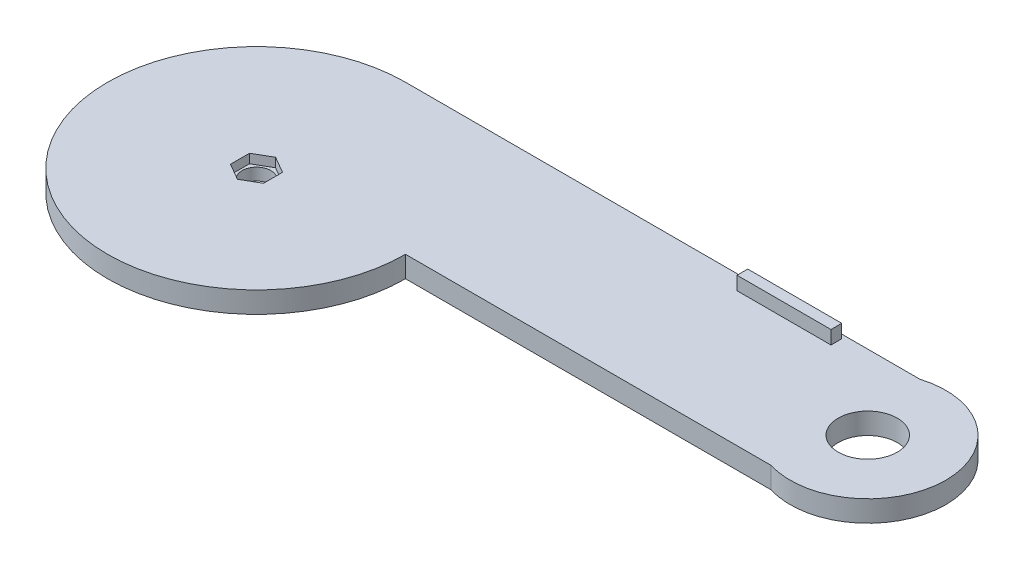
ISO-10303-21;
HEADER;
FILE_DESCRIPTION(('STEP AP214'),'2;1');
FILE_NAME('part.step','',(''),(''),'','','');
FILE_SCHEMA(('AUTOMOTIVE_DESIGN { 1 0 10303 214 1 1 1 1 }'));
ENDSEC;
DATA;
#1=APPLICATION_CONTEXT('core data for automotive mechanical design processes');
#2=APPLICATION_PROTOCOL_DEFINITION('international standard','automotive_design',2000,#1);
#3=PRODUCT_CONTEXT('',#1,'mechanical');
#4=PRODUCT('Part','Part','',(#3));
#5=PRODUCT_RELATED_PRODUCT_CATEGORY('part','',(#4));
#6=PRODUCT_DEFINITION_FORMATION('','',#4);
#7=PRODUCT_DEFINITION_CONTEXT('part definition',#1,'design');
#8=PRODUCT_DEFINITION('design','',#6,#7);
#9=PRODUCT_DEFINITION_SHAPE('','',#8);
#10=(LENGTH_UNIT() NAMED_UNIT(*) SI_UNIT(.MILLI.,.METRE.));
#11=(NAMED_UNIT(*) PLANE_ANGLE_UNIT() SI_UNIT($,.RADIAN.));
#12=(NAMED_UNIT(*) SI_UNIT($,.STERADIAN.) SOLID_ANGLE_UNIT());
#13=UNCERTAINTY_MEASURE_WITH_UNIT(LENGTH_MEASURE(1.E-05),#10,'distance_accuracy_value','');
#14=(GEOMETRIC_REPRESENTATION_CONTEXT(3) GLOBAL_UNCERTAINTY_ASSIGNED_CONTEXT((#13)) GLOBAL_UNIT_ASSIGNED_CONTEXT((#10,
#11,#12)) REPRESENTATION_CONTEXT('',''));
#15=CARTESIAN_POINT('',(0.,0.,0.));
#16=DIRECTION('',(0.,0.,1.));
#17=DIRECTION('',(1.,0.,0.));
#18=AXIS2_PLACEMENT_3D('',#15,#16,#17);
#19=CARTESIAN_POINT('',(0.,-2.1,0.));
#20=DIRECTION('',(0.,1.,0.));
#21=DIRECTION('',(0.,0.,1.));
#22=AXIS2_PLACEMENT_3D('',#19,#20,#21);
#23=CYLINDRICAL_SURFACE('',#22,5.34101538895491);
#24=CARTESIAN_POINT('',(0.,0.,0.));
#25=DIRECTION('',(0.,1.,0.));
#26=DIRECTION('',(0.,0.,1.));
#27=AXIS2_PLACEMENT_3D('',#24,#25,#26);
#28=CIRCLE('',#27,5.34101538895491);
#29=CARTESIAN_POINT('',(0.,0.,5.34101538895491));
#30=VERTEX_POINT('',#29);
#31=EDGE_CURVE('E202',#30,#30,#28,.T.);
#32=ORIENTED_EDGE('',*,*,#31,.F.);
#33=EDGE_LOOP('',(#32));
#34=FACE_BOUND('',#33,.T.);
#35=CARTESIAN_POINT('',(0.,4.5,0.));
#36=DIRECTION('',(0.,1.,0.));
#37=DIRECTION('',(0.,0.,1.));
#38=AXIS2_PLACEMENT_3D('',#35,#36,#37);
#39=CIRCLE('',#38,5.34101538895491);
#40=CARTESIAN_POINT('',(0.,4.5,5.34101538895491));
#41=VERTEX_POINT('',#40);
#42=EDGE_CURVE('E41',#41,#41,#39,.F.);
#43=ORIENTED_EDGE('',*,*,#42,.F.);
#44=EDGE_LOOP('',(#43));
#45=FACE_BOUND('',#44,.T.);
#46=ADVANCED_FACE('F37',(#34,#45),#23,.F.);
#47=CARTESIAN_POINT('',(0.,7.9,0.));
#48=DIRECTION('',(0.,1.,0.));
#49=DIRECTION('',(0.,0.,1.));
#50=AXIS2_PLACEMENT_3D('',#47,#48,#49);
#51=PLANE('',#50);
#52=DIRECTION('',(-0.866025403784439,0.,-0.5));
#53=VECTOR('',#52,1.);
#54=CARTESIAN_POINT('',(6.14878036686951,7.9,-3.55));
#55=LINE('',#54,#53);
#56=CARTESIAN_POINT('',(6.14878036686951,7.9,-3.55));
#57=VERTEX_POINT('',#56);
#58=CARTESIAN_POINT('',(0.,7.9,-7.1));
#59=VERTEX_POINT('',#58);
#60=EDGE_CURVE('E54',#57,#59,#55,.T.);
#61=ORIENTED_EDGE('',*,*,#60,.F.);
#62=DIRECTION('',(0.,0.,-1.));
#63=VECTOR('',#62,1.);
#64=CARTESIAN_POINT('',(6.14878036686951,7.9,3.55));
#65=LINE('',#64,#63);
#66=CARTESIAN_POINT('',(6.14878036686951,7.9,3.55));
#67=VERTEX_POINT('',#66);
#68=EDGE_CURVE('E162',#67,#57,#65,.T.);
#69=ORIENTED_EDGE('',*,*,#68,.F.);
#70=DIRECTION('',(0.866025403784439,0.,-0.5));
#71=VECTOR('',#70,1.);
#72=CARTESIAN_POINT('',(0.,7.9,7.1));
#73=LINE('',#72,#71);
#74=CARTESIAN_POINT('',(0.,7.9,7.1));
#75=VERTEX_POINT('',#74);
#76=EDGE_CURVE('E165',#75,#67,#73,.T.);
#77=ORIENTED_EDGE('',*,*,#76,.F.);
#78=DIRECTION('',(0.866025403784439,0.,0.5));
#79=VECTOR('',#78,1.);
#80=CARTESIAN_POINT('',(-6.14878036686951,7.9,3.55));
#81=LINE('',#80,#79);
#82=CARTESIAN_POINT('',(-6.14878036686951,7.9,3.55));
#83=VERTEX_POINT('',#82);
#84=EDGE_CURVE('E181',#83,#75,#81,.T.);
#85=ORIENTED_EDGE('',*,*,#84,.F.);
#86=DIRECTION('',(0.,0.,1.));
#87=VECTOR('',#86,1.);
#88=CARTESIAN_POINT('',(-6.14878036686952,7.9,-3.55));
#89=LINE('',#88,#87);
#90=CARTESIAN_POINT('',(-6.14878036686952,7.9,-3.55));
#91=VERTEX_POINT('',#90);
#92=EDGE_CURVE('E178',#91,#83,#89,.T.);
#93=ORIENTED_EDGE('',*,*,#92,.F.);
#94=DIRECTION('',(-0.866025403784439,0.,0.5));
#95=VECTOR('',#94,1.);
#96=CARTESIAN_POINT('',(0.,7.9,-7.1));
#97=LINE('',#96,#95);
#98=EDGE_CURVE('E176',#59,#91,#97,.T.);
#99=ORIENTED_EDGE('',*,*,#98,.F.);
#100=EDGE_LOOP('',(#61,#69,#77,#85,#93,#99));
#101=FACE_BOUND('',#100,.T.);
#102=CARTESIAN_POINT('',(199.92,7.9,-27.749938535464));
#103=DIRECTION('',(0.,1.,0.));
#104=DIRECTION('',(0.,0.,1.));
#105=AXIS2_PLACEMENT_3D('',#102,#103,#104);
#106=CIRCLE('',#105,11.);
#107=CARTESIAN_POINT('',(199.92,7.9,-16.749938535464));
#108=VERTEX_POINT('',#107);
#109=EDGE_CURVE('E199',#108,#108,#106,.T.);
#110=ORIENTED_EDGE('',*,*,#109,.F.);
#111=EDGE_LOOP('',(#110));
#112=FACE_BOUND('',#111,.T.);
#113=CARTESIAN_POINT('',(0.,7.9,0.));
#114=DIRECTION('',(0.,1.,0.));
#115=DIRECTION('',(0.,0.,1.));
#116=AXIS2_PLACEMENT_3D('',#113,#114,#115);
#117=CIRCLE('',#116,55.5);
#118=CARTESIAN_POINT('',(0.,7.9,-55.5));
#119=VERTEX_POINT('',#118);
#120=CARTESIAN_POINT('',(55.5,7.9,0.));
#121=VERTEX_POINT('',#120);
#122=EDGE_CURVE('E230',#119,#121,#117,.T.);
#123=ORIENTED_EDGE('',*,*,#122,.T.);
#124=DIRECTION('',(-1.,0.,0.));
#125=VECTOR('',#124,1.);
#126=CARTESIAN_POINT('',(0.,7.9,0.));
#127=LINE('',#126,#125);
#128=CARTESIAN_POINT('',(191.577559736039,7.9,0.));
#129=VERTEX_POINT('',#128);
#130=EDGE_CURVE('E232',#129,#121,#127,.T.);
#131=ORIENTED_EDGE('',*,*,#130,.F.);
#132=CARTESIAN_POINT('',(200.,7.9,-27.75));
#133=DIRECTION('',(0.,1.,0.));
#134=DIRECTION('',(0.,0.,1.));
#135=AXIS2_PLACEMENT_3D('',#132,#133,#134);
#136=CIRCLE('',#135,29.);
#137=CARTESIAN_POINT('',(191.577559736039,7.9,-55.5));
#138=VERTEX_POINT('',#137);
#139=EDGE_CURVE('E236',#129,#138,#136,.T.);
#140=ORIENTED_EDGE('',*,*,#139,.T.);
#141=DIRECTION('',(1.,0.,0.));
#142=VECTOR('',#141,1.);
#143=CARTESIAN_POINT('',(0.,7.9,-55.5));
#144=LINE('',#143,#142);
#145=EDGE_CURVE('E238',#119,#138,#144,.T.);
#146=ORIENTED_EDGE('',*,*,#145,.F.);
#147=EDGE_LOOP('',(#123,#131,#140,#146));
#148=FACE_BOUND('',#147,.T.);
#149=DIRECTION('',(1.,0.,0.));
#150=VECTOR('',#149,1.);
#151=CARTESIAN_POINT('',(129.,7.9,-49.9800718384467));
#152=LINE('',#151,#150);
#153=CARTESIAN_POINT('',(129.,7.9,-49.9800718384467));
#154=VERTEX_POINT('',#153);
#155=CARTESIAN_POINT('',(164.,7.9,-49.9800718384467));
#156=VERTEX_POINT('',#155);
#157=EDGE_CURVE('E216',#154,#156,#152,.T.);
#158=ORIENTED_EDGE('',*,*,#157,.F.);
#159=DIRECTION('',(0.,0.,1.));
#160=VECTOR('',#159,1.);
#161=CARTESIAN_POINT('',(129.,7.9,-49.9800718384467));
#162=LINE('',#161,#160);
#163=CARTESIAN_POINT('',(129.,7.9,-53.9800718384467));
#164=VERTEX_POINT('',#163);
#165=EDGE_CURVE('E198',#164,#154,#162,.T.);
#166=ORIENTED_EDGE('',*,*,#165,.F.);
#167=DIRECTION('',(-1.,0.,0.));
#168=VECTOR('',#167,1.);
#169=CARTESIAN_POINT('',(129.,7.9,-53.9800718384467));
#170=LINE('',#169,#168);
#171=CARTESIAN_POINT('',(164.,7.9,-53.9800718384467));
#172=VERTEX_POINT('',#171);
#173=EDGE_CURVE('E207',#172,#164,#170,.T.);
#174=ORIENTED_EDGE('',*,*,#173,.F.);
#175=DIRECTION('',(0.,0.,-1.));
#176=VECTOR('',#175,1.);
#177=CARTESIAN_POINT('',(164.,7.9,-49.9800718384467));
#178=LINE('',#177,#176);
#179=EDGE_CURVE('E218',#156,#172,#178,.T.);
#180=ORIENTED_EDGE('',*,*,#179,.F.);
#181=EDGE_LOOP('',(#158,#166,#174,#180));
#182=FACE_BOUND('',#181,.T.);
#183=ADVANCED_FACE('F262',(#101,#112,#148,#182),#51,.T.);
#184=CARTESIAN_POINT('',(0.,7.9,0.));
#185=DIRECTION('',(0.,-1.,0.));
#186=DIRECTION('',(0.,0.,-1.));
#187=AXIS2_PLACEMENT_3D('',#184,#185,#186);
#188=CYLINDRICAL_SURFACE('',#187,55.5);
#189=CARTESIAN_POINT('',(0.,0.,0.));
#190=DIRECTION('',(0.,1.,0.));
#191=DIRECTION('',(0.,0.,1.));
#192=AXIS2_PLACEMENT_3D('',#189,#190,#191);
#193=CIRCLE('',#192,55.5);
#194=CARTESIAN_POINT('',(0.,0.,-55.5));
#195=VERTEX_POINT('',#194);
#196=CARTESIAN_POINT('',(55.5,0.,0.));
#197=VERTEX_POINT('',#196);
#198=EDGE_CURVE('E229',#195,#197,#193,.T.);
#199=ORIENTED_EDGE('',*,*,#198,.T.);
#200=DIRECTION('',(0.,-1.,0.));
#201=VECTOR('',#200,1.);
#202=CARTESIAN_POINT('',(55.5,7.9,0.));
#203=LINE('',#202,#201);
#204=EDGE_CURVE('E11',#121,#197,#203,.T.);
#205=ORIENTED_EDGE('',*,*,#204,.F.);
#206=ORIENTED_EDGE('',*,*,#122,.F.);
#207=DIRECTION('',(0.,-1.,0.));
#208=VECTOR('',#207,1.);
#209=CARTESIAN_POINT('',(0.,7.9,-55.5));
#210=LINE('',#209,#208);
#211=EDGE_CURVE('E241',#119,#195,#210,.T.);
#212=ORIENTED_EDGE('',*,*,#211,.T.);
#213=EDGE_LOOP('',(#199,#205,#206,#212));
#214=FACE_BOUND('',#213,.T.);
#215=ADVANCED_FACE('F39',(#214),#188,.T.);
#216=CARTESIAN_POINT('',(0.,7.9,0.));
#217=DIRECTION('',(0.,0.,1.));
#218=DIRECTION('',(1.,0.,0.));
#219=AXIS2_PLACEMENT_3D('',#216,#217,#218);
#220=PLANE('',#219);
#221=DIRECTION('',(-1.,0.,0.));
#222=VECTOR('',#221,1.);
#223=CARTESIAN_POINT('',(0.,0.,0.));
#224=LINE('',#223,#222);
#225=CARTESIAN_POINT('',(191.577559736039,0.,0.));
#226=VERTEX_POINT('',#225);
#227=EDGE_CURVE('E244',#226,#197,#224,.T.);
#228=ORIENTED_EDGE('',*,*,#227,.F.);
#229=DIRECTION('',(0.,-1.,0.));
#230=VECTOR('',#229,1.);
#231=CARTESIAN_POINT('',(191.577559736039,7.9,0.));
#232=LINE('',#231,#230);
#233=EDGE_CURVE('E46',#129,#226,#232,.T.);
#234=ORIENTED_EDGE('',*,*,#233,.F.);
#235=ORIENTED_EDGE('',*,*,#130,.T.);
#236=ORIENTED_EDGE('',*,*,#204,.T.);
#237=EDGE_LOOP('',(#228,#234,#235,#236));
#238=FACE_BOUND('',#237,.T.);
#239=ADVANCED_FACE('F305',(#238),#220,.T.);
#240=CARTESIAN_POINT('',(200.,7.9,-27.75));
#241=DIRECTION('',(0.,-1.,0.));
#242=DIRECTION('',(0.,0.,-1.));
#243=AXIS2_PLACEMENT_3D('',#240,#241,#242);
#244=CYLINDRICAL_SURFACE('',#243,29.);
#245=CARTESIAN_POINT('',(200.,0.,-27.75));
#246=DIRECTION('',(0.,1.,0.));
#247=DIRECTION('',(0.,0.,1.));
#248=AXIS2_PLACEMENT_3D('',#245,#246,#247);
#249=CIRCLE('',#248,29.);
#250=CARTESIAN_POINT('',(191.577559736039,0.,-55.5));
#251=VERTEX_POINT('',#250);
#252=EDGE_CURVE('E247',#226,#251,#249,.T.);
#253=ORIENTED_EDGE('',*,*,#252,.T.);
#254=DIRECTION('',(0.,-1.,0.));
#255=VECTOR('',#254,1.);
#256=CARTESIAN_POINT('',(191.577559736039,7.9,-55.5));
#257=LINE('',#256,#255);
#258=EDGE_CURVE('E253',#138,#251,#257,.T.);
#259=ORIENTED_EDGE('',*,*,#258,.F.);
#260=ORIENTED_EDGE('',*,*,#139,.F.);
#261=ORIENTED_EDGE('',*,*,#233,.T.);
#262=EDGE_LOOP('',(#253,#259,#260,#261));
#263=FACE_BOUND('',#262,.T.);
#264=ADVANCED_FACE('F302',(#263),#244,.T.);
#265=CARTESIAN_POINT('',(0.,7.9,-55.5));
#266=DIRECTION('',(0.,0.,-1.));
#267=DIRECTION('',(-1.,0.,0.));
#268=AXIS2_PLACEMENT_3D('',#265,#266,#267);
#269=PLANE('',#268);
#270=DIRECTION('',(1.,0.,0.));
#271=VECTOR('',#270,1.);
#272=CARTESIAN_POINT('',(0.,0.,-55.5));
#273=LINE('',#272,#271);
#274=EDGE_CURVE('E233',#195,#251,#273,.T.);
#275=ORIENTED_EDGE('',*,*,#274,.F.);
#276=ORIENTED_EDGE('',*,*,#211,.F.);
#277=ORIENTED_EDGE('',*,*,#145,.T.);
#278=ORIENTED_EDGE('',*,*,#258,.T.);
#279=EDGE_LOOP('',(#275,#276,#277,#278));
#280=FACE_BOUND('',#279,.T.);
#281=ADVANCED_FACE('F299',(#280),#269,.T.);
#282=CARTESIAN_POINT('',(0.,0.,0.));
#283=DIRECTION('',(0.,1.,0.));
#284=DIRECTION('',(0.,0.,1.));
#285=AXIS2_PLACEMENT_3D('',#282,#283,#284);
#286=PLANE('',#285);
#287=ORIENTED_EDGE('',*,*,#31,.T.);
#288=EDGE_LOOP('',(#287));
#289=FACE_BOUND('',#288,.T.);
#290=CARTESIAN_POINT('',(199.92,0.,-27.749938535464));
#291=DIRECTION('',(0.,1.,0.));
#292=DIRECTION('',(0.,0.,1.));
#293=AXIS2_PLACEMENT_3D('',#290,#291,#292);
#294=CIRCLE('',#293,11.);
#295=CARTESIAN_POINT('',(199.92,0.,-16.749938535464));
#296=VERTEX_POINT('',#295);
#297=EDGE_CURVE('E195',#296,#296,#294,.T.);
#298=ORIENTED_EDGE('',*,*,#297,.T.);
#299=EDGE_LOOP('',(#298));
#300=FACE_BOUND('',#299,.T.);
#301=ORIENTED_EDGE('',*,*,#198,.F.);
#302=ORIENTED_EDGE('',*,*,#274,.T.);
#303=ORIENTED_EDGE('',*,*,#252,.F.);
#304=ORIENTED_EDGE('',*,*,#227,.T.);
#305=EDGE_LOOP('',(#301,#302,#303,#304));
#306=FACE_BOUND('',#305,.T.);
#307=ADVANCED_FACE('F294',(#289,#300,#306),#286,.F.);
#308=CARTESIAN_POINT('',(129.,12.9,-49.9800718384467));
#309=DIRECTION('',(1.,0.,0.));
#310=DIRECTION('',(0.,0.,-1.));
#311=AXIS2_PLACEMENT_3D('',#308,#309,#310);
#312=PLANE('',#311);
#313=ORIENTED_EDGE('',*,*,#165,.T.);
#314=DIRECTION('',(0.,-1.,0.));
#315=VECTOR('',#314,1.);
#316=CARTESIAN_POINT('',(129.,12.9,-49.9800718384467));
#317=LINE('',#316,#315);
#318=CARTESIAN_POINT('',(129.,12.9,-49.9800718384467));
#319=VERTEX_POINT('',#318);
#320=EDGE_CURVE('E227',#319,#154,#317,.T.);
#321=ORIENTED_EDGE('',*,*,#320,.F.);
#322=DIRECTION('',(0.,0.,1.));
#323=VECTOR('',#322,1.);
#324=CARTESIAN_POINT('',(129.,12.9,-49.9800718384467));
#325=LINE('',#324,#323);
#326=CARTESIAN_POINT('',(129.,12.9,-53.9800718384467));
#327=VERTEX_POINT('',#326);
#328=EDGE_CURVE('E203',#327,#319,#325,.T.);
#329=ORIENTED_EDGE('',*,*,#328,.F.);
#330=DIRECTION('',(0.,-1.,0.));
#331=VECTOR('',#330,1.);
#332=CARTESIAN_POINT('',(129.,12.9,-53.9800718384467));
#333=LINE('',#332,#331);
#334=EDGE_CURVE('E213',#327,#164,#333,.T.);
#335=ORIENTED_EDGE('',*,*,#334,.T.);
#336=EDGE_LOOP('',(#313,#321,#329,#335));
#337=FACE_BOUND('',#336,.T.);
#338=ADVANCED_FACE('F291',(#337),#312,.F.);
#339=CARTESIAN_POINT('',(129.,12.9,-49.9800718384467));
#340=DIRECTION('',(0.,0.,-1.));
#341=DIRECTION('',(-1.,0.,0.));
#342=AXIS2_PLACEMENT_3D('',#339,#340,#341);
#343=PLANE('',#342);
#344=ORIENTED_EDGE('',*,*,#157,.T.);
#345=DIRECTION('',(0.,-1.,0.));
#346=VECTOR('',#345,1.);
#347=CARTESIAN_POINT('',(164.,12.9,-49.9800718384467));
#348=LINE('',#347,#346);
#349=CARTESIAN_POINT('',(164.,12.9,-49.9800718384467));
#350=VERTEX_POINT('',#349);
#351=EDGE_CURVE('E224',#350,#156,#348,.T.);
#352=ORIENTED_EDGE('',*,*,#351,.F.);
#353=DIRECTION('',(1.,0.,0.));
#354=VECTOR('',#353,1.);
#355=CARTESIAN_POINT('',(129.,12.9,-49.9800718384467));
#356=LINE('',#355,#354);
#357=EDGE_CURVE('E206',#319,#350,#356,.T.);
#358=ORIENTED_EDGE('',*,*,#357,.F.);
#359=ORIENTED_EDGE('',*,*,#320,.T.);
#360=EDGE_LOOP('',(#344,#352,#358,#359));
#361=FACE_BOUND('',#360,.T.);
#362=ADVANCED_FACE('F287',(#361),#343,.F.);
#363=CARTESIAN_POINT('',(164.,12.9,-49.9800718384467));
#364=DIRECTION('',(-1.,0.,0.));
#365=DIRECTION('',(0.,0.,1.));
#366=AXIS2_PLACEMENT_3D('',#363,#364,#365);
#367=PLANE('',#366);
#368=ORIENTED_EDGE('',*,*,#179,.T.);
#369=DIRECTION('',(0.,-1.,0.));
#370=VECTOR('',#369,1.);
#371=CARTESIAN_POINT('',(164.,12.9,-53.9800718384467));
#372=LINE('',#371,#370);
#373=CARTESIAN_POINT('',(164.,12.9,-53.9800718384467));
#374=VERTEX_POINT('',#373);
#375=EDGE_CURVE('E62',#374,#172,#372,.T.);
#376=ORIENTED_EDGE('',*,*,#375,.F.);
#377=DIRECTION('',(0.,0.,-1.));
#378=VECTOR('',#377,1.);
#379=CARTESIAN_POINT('',(164.,12.9,-49.9800718384467));
#380=LINE('',#379,#378);
#381=EDGE_CURVE('E209',#350,#374,#380,.T.);
#382=ORIENTED_EDGE('',*,*,#381,.F.);
#383=ORIENTED_EDGE('',*,*,#351,.T.);
#384=EDGE_LOOP('',(#368,#376,#382,#383));
#385=FACE_BOUND('',#384,.T.);
#386=ADVANCED_FACE('F284',(#385),#367,.F.);
#387=CARTESIAN_POINT('',(129.,12.9,-53.9800718384467));
#388=DIRECTION('',(0.,0.,1.));
#389=DIRECTION('',(1.,0.,0.));
#390=AXIS2_PLACEMENT_3D('',#387,#388,#389);
#391=PLANE('',#390);
#392=ORIENTED_EDGE('',*,*,#173,.T.);
#393=ORIENTED_EDGE('',*,*,#334,.F.);
#394=DIRECTION('',(-1.,0.,0.));
#395=VECTOR('',#394,1.);
#396=CARTESIAN_POINT('',(129.,12.9,-53.9800718384467));
#397=LINE('',#396,#395);
#398=EDGE_CURVE('E211',#374,#327,#397,.T.);
#399=ORIENTED_EDGE('',*,*,#398,.F.);
#400=ORIENTED_EDGE('',*,*,#375,.T.);
#401=EDGE_LOOP('',(#392,#393,#399,#400));
#402=FACE_BOUND('',#401,.T.);
#403=ADVANCED_FACE('F280',(#402),#391,.F.);
#404=CARTESIAN_POINT('',(0.,12.9,0.));
#405=DIRECTION('',(0.,-1.,0.));
#406=DIRECTION('',(0.,0.,-1.));
#407=AXIS2_PLACEMENT_3D('',#404,#405,#406);
#408=PLANE('',#407);
#409=ORIENTED_EDGE('',*,*,#328,.T.);
#410=ORIENTED_EDGE('',*,*,#357,.T.);
#411=ORIENTED_EDGE('',*,*,#381,.T.);
#412=ORIENTED_EDGE('',*,*,#398,.T.);
#413=EDGE_LOOP('',(#409,#410,#411,#412));
#414=FACE_BOUND('',#413,.T.);
#415=ADVANCED_FACE('F276',(#414),#408,.F.);
#416=CARTESIAN_POINT('',(199.92,0.,-27.749938535464));
#417=DIRECTION('',(0.,1.,0.));
#418=DIRECTION('',(0.,0.,1.));
#419=AXIS2_PLACEMENT_3D('',#416,#417,#418);
#420=CYLINDRICAL_SURFACE('',#419,11.);
#421=ORIENTED_EDGE('',*,*,#297,.F.);
#422=EDGE_LOOP('',(#421));
#423=FACE_BOUND('',#422,.T.);
#424=ORIENTED_EDGE('',*,*,#109,.T.);
#425=EDGE_LOOP('',(#424));
#426=FACE_BOUND('',#425,.T.);
#427=ADVANCED_FACE('F273',(#423,#426),#420,.F.);
#428=CARTESIAN_POINT('',(0.,4.5,0.));
#429=DIRECTION('',(0.,1.,0.));
#430=DIRECTION('',(0.,0.,1.));
#431=AXIS2_PLACEMENT_3D('',#428,#429,#430);
#432=PLANE('',#431);
#433=DIRECTION('',(-0.866025403784439,0.,-0.5));
#434=VECTOR('',#433,1.);
#435=CARTESIAN_POINT('',(6.14878036686951,4.5,-3.55));
#436=LINE('',#435,#434);
#437=CARTESIAN_POINT('',(6.14878036686951,4.5,-3.55));
#438=VERTEX_POINT('',#437);
#439=CARTESIAN_POINT('',(0.,4.5,-7.1));
#440=VERTEX_POINT('',#439);
#441=EDGE_CURVE('E142',#438,#440,#436,.T.);
#442=ORIENTED_EDGE('',*,*,#441,.T.);
#443=DIRECTION('',(-0.866025403784439,0.,0.5));
#444=VECTOR('',#443,1.);
#445=CARTESIAN_POINT('',(0.,4.5,-7.1));
#446=LINE('',#445,#444);
#447=CARTESIAN_POINT('',(-6.14878036686952,4.5,-3.55));
#448=VERTEX_POINT('',#447);
#449=EDGE_CURVE('E151',#440,#448,#446,.T.);
#450=ORIENTED_EDGE('',*,*,#449,.T.);
#451=DIRECTION('',(0.,0.,1.));
#452=VECTOR('',#451,1.);
#453=CARTESIAN_POINT('',(-6.14878036686952,4.5,-3.55));
#454=LINE('',#453,#452);
#455=CARTESIAN_POINT('',(-6.14878036686951,4.5,3.55));
#456=VERTEX_POINT('',#455);
#457=EDGE_CURVE('E156',#448,#456,#454,.T.);
#458=ORIENTED_EDGE('',*,*,#457,.T.);
#459=DIRECTION('',(0.866025403784439,0.,0.5));
#460=VECTOR('',#459,1.);
#461=CARTESIAN_POINT('',(-6.14878036686951,4.5,3.55));
#462=LINE('',#461,#460);
#463=CARTESIAN_POINT('',(0.,4.5,7.1));
#464=VERTEX_POINT('',#463);
#465=EDGE_CURVE('E169',#456,#464,#462,.T.);
#466=ORIENTED_EDGE('',*,*,#465,.T.);
#467=DIRECTION('',(0.866025403784439,0.,-0.5));
#468=VECTOR('',#467,1.);
#469=CARTESIAN_POINT('',(0.,4.5,7.1));
#470=LINE('',#469,#468);
#471=CARTESIAN_POINT('',(6.14878036686951,4.5,3.55));
#472=VERTEX_POINT('',#471);
#473=EDGE_CURVE('E172',#464,#472,#470,.T.);
#474=ORIENTED_EDGE('',*,*,#473,.T.);
#475=DIRECTION('',(0.,0.,-1.));
#476=VECTOR('',#475,1.);
#477=CARTESIAN_POINT('',(6.14878036686951,4.5,3.55));
#478=LINE('',#477,#476);
#479=EDGE_CURVE('E148',#472,#438,#478,.T.);
#480=ORIENTED_EDGE('',*,*,#479,.T.);
#481=EDGE_LOOP('',(#442,#450,#458,#466,#474,#480));
#482=FACE_BOUND('',#481,.T.);
#483=ORIENTED_EDGE('',*,*,#42,.T.);
#484=EDGE_LOOP('',(#483));
#485=FACE_BOUND('',#484,.T.);
#486=ADVANCED_FACE('F158',(#482,#485),#432,.T.);
#487=CARTESIAN_POINT('',(6.14878036686951,4.5,-3.55));
#488=DIRECTION('',(0.5,0.,-0.866025403784439));
#489=DIRECTION('',(-0.866025403784439,0.,-0.5));
#490=AXIS2_PLACEMENT_3D('',#487,#488,#489);
#491=PLANE('',#490);
#492=ORIENTED_EDGE('',*,*,#60,.T.);
#493=DIRECTION('',(0.,1.,0.));
#494=VECTOR('',#493,1.);
#495=CARTESIAN_POINT('',(0.,4.5,-7.1));
#496=LINE('',#495,#494);
#497=EDGE_CURVE('E138',#440,#59,#496,.T.);
#498=ORIENTED_EDGE('',*,*,#497,.F.);
#499=ORIENTED_EDGE('',*,*,#441,.F.);
#500=DIRECTION('',(0.,1.,0.));
#501=VECTOR('',#500,1.);
#502=CARTESIAN_POINT('',(6.14878036686951,4.5,-3.55));
#503=LINE('',#502,#501);
#504=EDGE_CURVE('E186',#438,#57,#503,.T.);
#505=ORIENTED_EDGE('',*,*,#504,.T.);
#506=EDGE_LOOP('',(#492,#498,#499,#505));
#507=FACE_BOUND('',#506,.T.);
#508=ADVANCED_FACE('F140',(#507),#491,.F.);
#509=CARTESIAN_POINT('',(6.14878036686951,4.5,3.55));
#510=DIRECTION('',(1.,0.,0.));
#511=DIRECTION('',(0.,0.,-1.));
#512=AXIS2_PLACEMENT_3D('',#509,#510,#511);
#513=PLANE('',#512);
#514=ORIENTED_EDGE('',*,*,#68,.T.);
#515=ORIENTED_EDGE('',*,*,#504,.F.);
#516=ORIENTED_EDGE('',*,*,#479,.F.);
#517=DIRECTION('',(0.,1.,0.));
#518=VECTOR('',#517,1.);
#519=CARTESIAN_POINT('',(6.14878036686951,4.5,3.55));
#520=LINE('',#519,#518);
#521=EDGE_CURVE('E188',#472,#67,#520,.T.);
#522=ORIENTED_EDGE('',*,*,#521,.T.);
#523=EDGE_LOOP('',(#514,#515,#516,#522));
#524=FACE_BOUND('',#523,.T.);
#525=ADVANCED_FACE('F363',(#524),#513,.F.);
#526=CARTESIAN_POINT('',(0.,4.5,7.1));
#527=DIRECTION('',(0.5,0.,0.866025403784439));
#528=DIRECTION('',(0.866025403784439,0.,-0.5));
#529=AXIS2_PLACEMENT_3D('',#526,#527,#528);
#530=PLANE('',#529);
#531=ORIENTED_EDGE('',*,*,#76,.T.);
#532=ORIENTED_EDGE('',*,*,#521,.F.);
#533=ORIENTED_EDGE('',*,*,#473,.F.);
#534=DIRECTION('',(0.,1.,0.));
#535=VECTOR('',#534,1.);
#536=CARTESIAN_POINT('',(0.,4.5,7.1));
#537=LINE('',#536,#535);
#538=EDGE_CURVE('E190',#464,#75,#537,.T.);
#539=ORIENTED_EDGE('',*,*,#538,.T.);
#540=EDGE_LOOP('',(#531,#532,#533,#539));
#541=FACE_BOUND('',#540,.T.);
#542=ADVANCED_FACE('F371',(#541),#530,.F.);
#543=CARTESIAN_POINT('',(-6.14878036686951,4.5,3.55));
#544=DIRECTION('',(-0.5,0.,0.866025403784439));
#545=DIRECTION('',(0.866025403784439,0.,0.5));
#546=AXIS2_PLACEMENT_3D('',#543,#544,#545);
#547=PLANE('',#546);
#548=ORIENTED_EDGE('',*,*,#84,.T.);
#549=ORIENTED_EDGE('',*,*,#538,.F.);
#550=ORIENTED_EDGE('',*,*,#465,.F.);
#551=DIRECTION('',(0.,1.,0.));
#552=VECTOR('',#551,1.);
#553=CARTESIAN_POINT('',(-6.14878036686951,4.5,3.55));
#554=LINE('',#553,#552);
#555=EDGE_CURVE('E192',#456,#83,#554,.T.);
#556=ORIENTED_EDGE('',*,*,#555,.T.);
#557=EDGE_LOOP('',(#548,#549,#550,#556));
#558=FACE_BOUND('',#557,.T.);
#559=ADVANCED_FACE('F381',(#558),#547,.F.);
#560=CARTESIAN_POINT('',(-6.14878036686952,4.5,-3.55));
#561=DIRECTION('',(-1.,0.,0.));
#562=DIRECTION('',(0.,0.,1.));
#563=AXIS2_PLACEMENT_3D('',#560,#561,#562);
#564=PLANE('',#563);
#565=ORIENTED_EDGE('',*,*,#92,.T.);
#566=ORIENTED_EDGE('',*,*,#555,.F.);
#567=ORIENTED_EDGE('',*,*,#457,.F.);
#568=DIRECTION('',(0.,1.,0.));
#569=VECTOR('',#568,1.);
#570=CARTESIAN_POINT('',(-6.14878036686952,4.5,-3.55));
#571=LINE('',#570,#569);
#572=EDGE_CURVE('E147',#448,#91,#571,.T.);
#573=ORIENTED_EDGE('',*,*,#572,.T.);
#574=EDGE_LOOP('',(#565,#566,#567,#573));
#575=FACE_BOUND('',#574,.T.);
#576=ADVANCED_FACE('F391',(#575),#564,.F.);
#577=CARTESIAN_POINT('',(0.,4.5,-7.1));
#578=DIRECTION('',(-0.5,0.,-0.866025403784439));
#579=DIRECTION('',(-0.866025403784439,0.,0.5));
#580=AXIS2_PLACEMENT_3D('',#577,#578,#579);
#581=PLANE('',#580);
#582=ORIENTED_EDGE('',*,*,#98,.T.);
#583=ORIENTED_EDGE('',*,*,#572,.F.);
#584=ORIENTED_EDGE('',*,*,#449,.F.);
#585=ORIENTED_EDGE('',*,*,#497,.T.);
#586=EDGE_LOOP('',(#582,#583,#584,#585));
#587=FACE_BOUND('',#586,.T.);
#588=ADVANCED_FACE('F152',(#587),#581,.F.);
#589=CLOSED_SHELL('',(#46,#183,#215,#239,#264,#281,#307,#338,#362,#386,#403,#415,#427,#486,#508,
#525,#542,#559,#576,#588));
#590=MANIFOLD_SOLID_BREP('B2',#589);
#591=ADVANCED_BREP_SHAPE_REPRESENTATION('',(#18,#590),#14);
#592=SHAPE_DEFINITION_REPRESENTATION(#9,#591);
ENDSEC;
END-ISO-10303-21;
